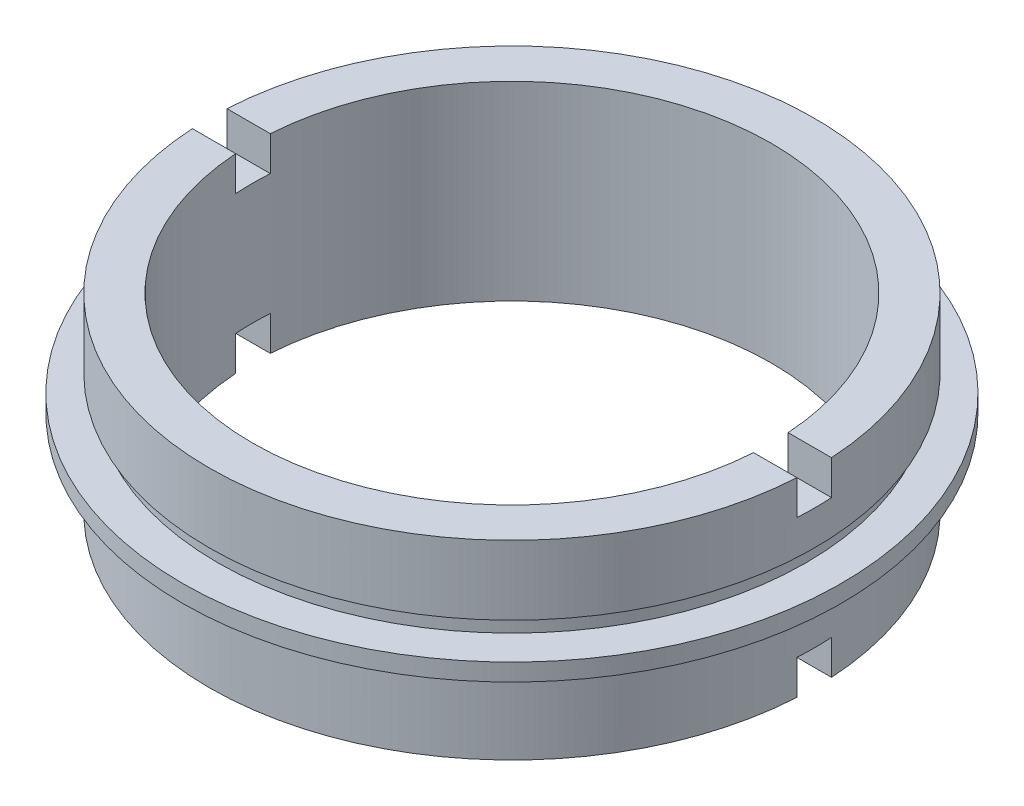
ISO-10303-21;
HEADER;
FILE_DESCRIPTION(('STEP AP214'),'2;1');
FILE_NAME('part.step','',(''),(''),'','','');
FILE_SCHEMA(('AUTOMOTIVE_DESIGN { 1 0 10303 214 1 1 1 1 }'));
ENDSEC;
DATA;
#1=APPLICATION_CONTEXT('core data for automotive mechanical design processes');
#2=APPLICATION_PROTOCOL_DEFINITION('international standard','automotive_design',2000,#1);
#3=PRODUCT_CONTEXT('',#1,'mechanical');
#4=PRODUCT('Part','Part','',(#3));
#5=PRODUCT_RELATED_PRODUCT_CATEGORY('part','',(#4));
#6=PRODUCT_DEFINITION_FORMATION('','',#4);
#7=PRODUCT_DEFINITION_CONTEXT('part definition',#1,'design');
#8=PRODUCT_DEFINITION('design','',#6,#7);
#9=PRODUCT_DEFINITION_SHAPE('','',#8);
#10=(LENGTH_UNIT() NAMED_UNIT(*) SI_UNIT(.MILLI.,.METRE.));
#11=(NAMED_UNIT(*) PLANE_ANGLE_UNIT() SI_UNIT($,.RADIAN.));
#12=(NAMED_UNIT(*) SI_UNIT($,.STERADIAN.) SOLID_ANGLE_UNIT());
#13=UNCERTAINTY_MEASURE_WITH_UNIT(LENGTH_MEASURE(1.E-05),#10,'distance_accuracy_value','');
#14=(GEOMETRIC_REPRESENTATION_CONTEXT(3) GLOBAL_UNCERTAINTY_ASSIGNED_CONTEXT((#13)) GLOBAL_UNIT_ASSIGNED_CONTEXT((#10,
#11,#12)) REPRESENTATION_CONTEXT('',''));
#15=CARTESIAN_POINT('',(0.,0.,0.));
#16=DIRECTION('',(0.,0.,1.));
#17=DIRECTION('',(1.,0.,0.));
#18=AXIS2_PLACEMENT_3D('',#15,#16,#17);
#19=CARTESIAN_POINT('',(-17.5,0.,0.));
#20=DIRECTION('',(0.,-1.,0.));
#21=DIRECTION('',(0.,0.,-1.));
#22=AXIS2_PLACEMENT_3D('',#19,#20,#21);
#23=PLANE('',#22);
#24=DIRECTION('',(-1.,0.,0.));
#25=VECTOR('',#24,1.);
#26=CARTESIAN_POINT('',(-17.5,0.,1.));
#27=LINE('',#26,#25);
#28=CARTESIAN_POINT('',(17.4714052096561,0.,1.));
#29=VERTEX_POINT('',#28);
#30=CARTESIAN_POINT('',(14.9666295470958,0.,1.));
#31=VERTEX_POINT('',#30);
#32=EDGE_CURVE('E265',#29,#31,#27,.T.);
#33=ORIENTED_EDGE('',*,*,#32,.F.);
#34=CARTESIAN_POINT('',(0.,0.,0.));
#35=DIRECTION('',(0.,1.,0.));
#36=DIRECTION('',(0.,0.,1.));
#37=AXIS2_PLACEMENT_3D('',#34,#35,#36);
#38=CIRCLE('',#37,17.5);
#39=CARTESIAN_POINT('',(-17.4714052096561,0.,1.));
#40=VERTEX_POINT('',#39);
#41=EDGE_CURVE('E214',#40,#29,#38,.T.);
#42=ORIENTED_EDGE('',*,*,#41,.F.);
#43=CARTESIAN_POINT('',(-14.9666295470958,0.,1.));
#44=VERTEX_POINT('',#43);
#45=EDGE_CURVE('E264',#44,#40,#27,.T.);
#46=ORIENTED_EDGE('',*,*,#45,.F.);
#47=CARTESIAN_POINT('',(0.,0.,0.));
#48=DIRECTION('',(0.,1.,0.));
#49=DIRECTION('',(0.,0.,1.));
#50=AXIS2_PLACEMENT_3D('',#47,#48,#49);
#51=CIRCLE('',#50,15.);
#52=EDGE_CURVE('E210',#44,#31,#51,.T.);
#53=ORIENTED_EDGE('',*,*,#52,.T.);
#54=EDGE_LOOP('',(#33,#42,#46,#53));
#55=FACE_BOUND('',#54,.T.);
#56=ADVANCED_FACE('F35',(#55),#23,.T.);
#57=CARTESIAN_POINT('',(-15.,11.,0.));
#58=DIRECTION('',(0.,1.,0.));
#59=DIRECTION('',(0.,0.,1.));
#60=AXIS2_PLACEMENT_3D('',#57,#58,#59);
#61=PLANE('',#60);
#62=DIRECTION('',(1.,0.,0.));
#63=VECTOR('',#62,1.);
#64=CARTESIAN_POINT('',(-15.,11.,1.));
#65=LINE('',#64,#63);
#66=CARTESIAN_POINT('',(-17.4714052096561,11.,1.));
#67=VERTEX_POINT('',#66);
#68=CARTESIAN_POINT('',(-14.9666295470958,11.,1.));
#69=VERTEX_POINT('',#68);
#70=EDGE_CURVE('E203',#67,#69,#65,.T.);
#71=ORIENTED_EDGE('',*,*,#70,.F.);
#72=CARTESIAN_POINT('',(0.,11.,0.));
#73=DIRECTION('',(0.,1.,0.));
#74=DIRECTION('',(0.,0.,1.));
#75=AXIS2_PLACEMENT_3D('',#72,#73,#74);
#76=CIRCLE('',#75,17.5);
#77=CARTESIAN_POINT('',(17.4714052096561,11.,1.));
#78=VERTEX_POINT('',#77);
#79=EDGE_CURVE('E241',#67,#78,#76,.T.);
#80=ORIENTED_EDGE('',*,*,#79,.T.);
#81=CARTESIAN_POINT('',(14.9666295470958,11.,1.));
#82=VERTEX_POINT('',#81);
#83=EDGE_CURVE('E206',#82,#78,#65,.T.);
#84=ORIENTED_EDGE('',*,*,#83,.F.);
#85=CARTESIAN_POINT('',(0.,11.,0.));
#86=DIRECTION('',(0.,1.,0.));
#87=DIRECTION('',(0.,0.,1.));
#88=AXIS2_PLACEMENT_3D('',#85,#86,#87);
#89=CIRCLE('',#88,15.);
#90=EDGE_CURVE('E245',#69,#82,#89,.T.);
#91=ORIENTED_EDGE('',*,*,#90,.F.);
#92=EDGE_LOOP('',(#71,#80,#84,#91));
#93=FACE_BOUND('',#92,.T.);
#94=ADVANCED_FACE('F303',(#93),#61,.T.);
#95=CARTESIAN_POINT('',(0.,22.6774994510759,0.));
#96=DIRECTION('',(0.,1.,0.));
#97=DIRECTION('',(0.,0.,1.));
#98=AXIS2_PLACEMENT_3D('',#95,#96,#97);
#99=CYLINDRICAL_SURFACE('',#98,15.);
#100=DIRECTION('',(0.,1.,0.));
#101=VECTOR('',#100,1.);
#102=CARTESIAN_POINT('',(-14.9666295470958,22.6774994510759,1.));
#103=LINE('',#102,#101);
#104=CARTESIAN_POINT('',(-14.9666295470958,2.,1.));
#105=VERTEX_POINT('',#104);
#106=EDGE_CURVE('E177',#105,#44,#103,.F.);
#107=ORIENTED_EDGE('',*,*,#106,.F.);
#108=CARTESIAN_POINT('',(0.,2.,0.));
#109=DIRECTION('',(0.,1.,0.));
#110=DIRECTION('',(0.,0.,1.));
#111=AXIS2_PLACEMENT_3D('',#108,#109,#110);
#112=CIRCLE('',#111,15.);
#113=CARTESIAN_POINT('',(-14.9666295470958,2.,-1.));
#114=VERTEX_POINT('',#113);
#115=EDGE_CURVE('E183',#114,#105,#112,.T.);
#116=ORIENTED_EDGE('',*,*,#115,.F.);
#117=DIRECTION('',(0.,1.,0.));
#118=VECTOR('',#117,1.);
#119=CARTESIAN_POINT('',(-14.9666295470958,22.6774994510759,-0.999999999999994));
#120=LINE('',#119,#118);
#121=CARTESIAN_POINT('',(-14.9666295470958,0.,-1.));
#122=VERTEX_POINT('',#121);
#123=EDGE_CURVE('E159',#122,#114,#120,.T.);
#124=ORIENTED_EDGE('',*,*,#123,.F.);
#125=CARTESIAN_POINT('',(14.9666295470958,0.,-1.));
#126=VERTEX_POINT('',#125);
#127=EDGE_CURVE('E213',#126,#122,#51,.T.);
#128=ORIENTED_EDGE('',*,*,#127,.F.);
#129=DIRECTION('',(0.,1.,0.));
#130=VECTOR('',#129,1.);
#131=CARTESIAN_POINT('',(14.9666295470958,22.6774994510759,-0.999999999999994));
#132=LINE('',#131,#130);
#133=CARTESIAN_POINT('',(14.9666295470958,2.,-1.));
#134=VERTEX_POINT('',#133);
#135=EDGE_CURVE('E58',#134,#126,#132,.F.);
#136=ORIENTED_EDGE('',*,*,#135,.F.);
#137=CARTESIAN_POINT('',(14.9666295470958,2.,1.));
#138=VERTEX_POINT('',#137);
#139=EDGE_CURVE('E185',#138,#134,#112,.T.);
#140=ORIENTED_EDGE('',*,*,#139,.F.);
#141=DIRECTION('',(0.,1.,0.));
#142=VECTOR('',#141,1.);
#143=CARTESIAN_POINT('',(14.9666295470958,22.6774994510759,1.));
#144=LINE('',#143,#142);
#145=EDGE_CURVE('E181',#31,#138,#144,.T.);
#146=ORIENTED_EDGE('',*,*,#145,.F.);
#147=ORIENTED_EDGE('',*,*,#52,.F.);
#148=EDGE_LOOP('',(#107,#116,#124,#128,#136,#140,#146,#147));
#149=FACE_BOUND('',#148,.T.);
#150=DIRECTION('',(0.,1.,0.));
#151=VECTOR('',#150,1.);
#152=CARTESIAN_POINT('',(14.9666295470958,22.6774994510759,1.));
#153=LINE('',#152,#151);
#154=CARTESIAN_POINT('',(14.9666295470958,9.,1.));
#155=VERTEX_POINT('',#154);
#156=EDGE_CURVE('E208',#155,#82,#153,.T.);
#157=ORIENTED_EDGE('',*,*,#156,.F.);
#158=CARTESIAN_POINT('',(0.,9.,0.));
#159=DIRECTION('',(0.,-1.,0.));
#160=DIRECTION('',(0.,0.,-1.));
#161=AXIS2_PLACEMENT_3D('',#158,#159,#160);
#162=CIRCLE('',#161,15.);
#163=CARTESIAN_POINT('',(14.9666295470958,9.,-0.999999999999997));
#164=VERTEX_POINT('',#163);
#165=EDGE_CURVE('E195',#164,#155,#162,.T.);
#166=ORIENTED_EDGE('',*,*,#165,.F.);
#167=DIRECTION('',(0.,1.,0.));
#168=VECTOR('',#167,1.);
#169=CARTESIAN_POINT('',(14.9666295470958,22.6774994510759,-1.));
#170=LINE('',#169,#168);
#171=CARTESIAN_POINT('',(14.9666295470958,11.,-0.999999999999998));
#172=VERTEX_POINT('',#171);
#173=EDGE_CURVE('E198',#172,#164,#170,.F.);
#174=ORIENTED_EDGE('',*,*,#173,.F.);
#175=CARTESIAN_POINT('',(-14.9666295470958,11.,-0.999999999999998));
#176=VERTEX_POINT('',#175);
#177=EDGE_CURVE('E248',#172,#176,#89,.T.);
#178=ORIENTED_EDGE('',*,*,#177,.T.);
#179=DIRECTION('',(0.,1.,0.));
#180=VECTOR('',#179,1.);
#181=CARTESIAN_POINT('',(-14.9666295470958,22.6774994510759,-1.));
#182=LINE('',#181,#180);
#183=CARTESIAN_POINT('',(-14.9666295470958,9.,-0.999999999999997));
#184=VERTEX_POINT('',#183);
#185=EDGE_CURVE('E201',#184,#176,#182,.T.);
#186=ORIENTED_EDGE('',*,*,#185,.F.);
#187=CARTESIAN_POINT('',(-14.9666295470958,9.,1.));
#188=VERTEX_POINT('',#187);
#189=EDGE_CURVE('E193',#188,#184,#162,.T.);
#190=ORIENTED_EDGE('',*,*,#189,.F.);
#191=DIRECTION('',(0.,1.,0.));
#192=VECTOR('',#191,1.);
#193=CARTESIAN_POINT('',(-14.9666295470958,22.6774994510759,1.));
#194=LINE('',#193,#192);
#195=EDGE_CURVE('E205',#69,#188,#194,.F.);
#196=ORIENTED_EDGE('',*,*,#195,.F.);
#197=ORIENTED_EDGE('',*,*,#90,.T.);
#198=EDGE_LOOP('',(#157,#166,#174,#178,#186,#190,#196,#197));
#199=FACE_BOUND('',#198,.T.);
#200=ADVANCED_FACE('F37',(#149,#199),#99,.F.);
#201=DIRECTION('',(-1.,0.,0.));
#202=VECTOR('',#201,1.);
#203=CARTESIAN_POINT('',(-15.,11.,-0.999999999999998));
#204=LINE('',#203,#202);
#205=CARTESIAN_POINT('',(17.4714052096561,11.,-1.));
#206=VERTEX_POINT('',#205);
#207=EDGE_CURVE('E196',#206,#172,#204,.T.);
#208=ORIENTED_EDGE('',*,*,#207,.F.);
#209=CARTESIAN_POINT('',(-17.4714052096561,11.,-1.));
#210=VERTEX_POINT('',#209);
#211=EDGE_CURVE('E244',#206,#210,#76,.T.);
#212=ORIENTED_EDGE('',*,*,#211,.T.);
#213=EDGE_CURVE('E199',#176,#210,#204,.T.);
#214=ORIENTED_EDGE('',*,*,#213,.F.);
#215=ORIENTED_EDGE('',*,*,#177,.F.);
#216=EDGE_LOOP('',(#208,#212,#214,#215));
#217=FACE_BOUND('',#216,.T.);
#218=ADVANCED_FACE('F309',(#217),#61,.T.);
#219=CARTESIAN_POINT('',(0.,22.6774994510759,0.));
#220=DIRECTION('',(0.,1.,0.));
#221=DIRECTION('',(0.,0.,1.));
#222=AXIS2_PLACEMENT_3D('',#219,#220,#221);
#223=CYLINDRICAL_SURFACE('',#222,17.5);
#224=DIRECTION('',(0.,1.,0.));
#225=VECTOR('',#224,1.);
#226=CARTESIAN_POINT('',(-17.4714052096561,22.6774994510759,1.));
#227=LINE('',#226,#225);
#228=CARTESIAN_POINT('',(-17.4714052096561,9.,1.));
#229=VERTEX_POINT('',#228);
#230=EDGE_CURVE('E260',#229,#67,#227,.T.);
#231=ORIENTED_EDGE('',*,*,#230,.F.);
#232=CARTESIAN_POINT('',(0.,9.,0.));
#233=DIRECTION('',(0.,-1.,0.));
#234=DIRECTION('',(0.,0.,-1.));
#235=AXIS2_PLACEMENT_3D('',#232,#233,#234);
#236=CIRCLE('',#235,17.5);
#237=CARTESIAN_POINT('',(-17.4714052096561,9.,-0.999999999999997));
#238=VERTEX_POINT('',#237);
#239=EDGE_CURVE('E252',#238,#229,#236,.F.);
#240=ORIENTED_EDGE('',*,*,#239,.F.);
#241=DIRECTION('',(0.,1.,0.));
#242=VECTOR('',#241,1.);
#243=CARTESIAN_POINT('',(-17.4714052096561,22.6774994510759,-1.));
#244=LINE('',#243,#242);
#245=EDGE_CURVE('E257',#210,#238,#244,.F.);
#246=ORIENTED_EDGE('',*,*,#245,.F.);
#247=ORIENTED_EDGE('',*,*,#211,.F.);
#248=DIRECTION('',(0.,1.,0.));
#249=VECTOR('',#248,1.);
#250=CARTESIAN_POINT('',(17.4714052096561,22.6774994510759,-1.));
#251=LINE('',#250,#249);
#252=CARTESIAN_POINT('',(17.4714052096561,9.,-0.999999999999997));
#253=VERTEX_POINT('',#252);
#254=EDGE_CURVE('E251',#253,#206,#251,.T.);
#255=ORIENTED_EDGE('',*,*,#254,.F.);
#256=CARTESIAN_POINT('',(17.4714052096561,9.,1.));
#257=VERTEX_POINT('',#256);
#258=EDGE_CURVE('E249',#257,#253,#236,.F.);
#259=ORIENTED_EDGE('',*,*,#258,.F.);
#260=DIRECTION('',(0.,1.,0.));
#261=VECTOR('',#260,1.);
#262=CARTESIAN_POINT('',(17.4714052096561,22.6774994510759,1.));
#263=LINE('',#262,#261);
#264=EDGE_CURVE('E254',#78,#257,#263,.F.);
#265=ORIENTED_EDGE('',*,*,#264,.F.);
#266=ORIENTED_EDGE('',*,*,#79,.F.);
#267=EDGE_LOOP('',(#231,#240,#246,#247,#255,#259,#265,#266));
#268=FACE_BOUND('',#267,.T.);
#269=CARTESIAN_POINT('',(0.,7.,0.));
#270=DIRECTION('',(0.,1.,0.));
#271=DIRECTION('',(0.,0.,1.));
#272=AXIS2_PLACEMENT_3D('',#269,#270,#271);
#273=CIRCLE('',#272,17.5);
#274=CARTESIAN_POINT('',(0.,7.,17.5));
#275=VERTEX_POINT('',#274);
#276=EDGE_CURVE('E238',#275,#275,#273,.T.);
#277=ORIENTED_EDGE('',*,*,#276,.T.);
#278=EDGE_LOOP('',(#277));
#279=FACE_BOUND('',#278,.T.);
#280=ADVANCED_FACE('F352',(#268,#279),#223,.T.);
#281=CARTESIAN_POINT('',(-17.5,7.,0.));
#282=DIRECTION('',(0.,-1.,0.));
#283=DIRECTION('',(0.,0.,-1.));
#284=AXIS2_PLACEMENT_3D('',#281,#282,#283);
#285=PLANE('',#284);
#286=CARTESIAN_POINT('',(0.,7.,0.));
#287=DIRECTION('',(0.,1.,0.));
#288=DIRECTION('',(0.,0.,1.));
#289=AXIS2_PLACEMENT_3D('',#286,#287,#288);
#290=CIRCLE('',#289,17.);
#291=CARTESIAN_POINT('',(0.,7.,17.));
#292=VERTEX_POINT('',#291);
#293=EDGE_CURVE('E235',#292,#292,#290,.T.);
#294=ORIENTED_EDGE('',*,*,#293,.T.);
#295=EDGE_LOOP('',(#294));
#296=FACE_BOUND('',#295,.T.);
#297=ORIENTED_EDGE('',*,*,#276,.F.);
#298=EDGE_LOOP('',(#297));
#299=FACE_BOUND('',#298,.T.);
#300=ADVANCED_FACE('F348',(#296,#299),#285,.T.);
#301=CARTESIAN_POINT('',(0.,22.6774994510759,0.));
#302=DIRECTION('',(0.,1.,0.));
#303=DIRECTION('',(0.,0.,1.));
#304=AXIS2_PLACEMENT_3D('',#301,#302,#303);
#305=CYLINDRICAL_SURFACE('',#304,17.);
#306=CARTESIAN_POINT('',(0.,6.,0.));
#307=DIRECTION('',(0.,1.,0.));
#308=DIRECTION('',(0.,0.,1.));
#309=AXIS2_PLACEMENT_3D('',#306,#307,#308);
#310=CIRCLE('',#309,17.);
#311=CARTESIAN_POINT('',(0.,6.,17.));
#312=VERTEX_POINT('',#311);
#313=EDGE_CURVE('E232',#312,#312,#310,.T.);
#314=ORIENTED_EDGE('',*,*,#313,.T.);
#315=EDGE_LOOP('',(#314));
#316=FACE_BOUND('',#315,.T.);
#317=ORIENTED_EDGE('',*,*,#293,.F.);
#318=EDGE_LOOP('',(#317));
#319=FACE_BOUND('',#318,.T.);
#320=ADVANCED_FACE('F344',(#316,#319),#305,.T.);
#321=CARTESIAN_POINT('',(-17.,6.,0.));
#322=DIRECTION('',(0.,1.,0.));
#323=DIRECTION('',(0.,0.,1.));
#324=AXIS2_PLACEMENT_3D('',#321,#322,#323);
#325=PLANE('',#324);
#326=CARTESIAN_POINT('',(0.,6.,0.));
#327=DIRECTION('',(0.,1.,0.));
#328=DIRECTION('',(0.,0.,1.));
#329=AXIS2_PLACEMENT_3D('',#326,#327,#328);
#330=CIRCLE('',#329,19.05);
#331=CARTESIAN_POINT('',(0.,6.,19.05));
#332=VERTEX_POINT('',#331);
#333=EDGE_CURVE('E229',#332,#332,#330,.T.);
#334=ORIENTED_EDGE('',*,*,#333,.T.);
#335=EDGE_LOOP('',(#334));
#336=FACE_BOUND('',#335,.T.);
#337=ORIENTED_EDGE('',*,*,#313,.F.);
#338=EDGE_LOOP('',(#337));
#339=FACE_BOUND('',#338,.T.);
#340=ADVANCED_FACE('F340',(#336,#339),#325,.T.);
#341=CARTESIAN_POINT('',(0.,22.6774994510759,0.));
#342=DIRECTION('',(0.,1.,0.));
#343=DIRECTION('',(0.,0.,1.));
#344=AXIS2_PLACEMENT_3D('',#341,#342,#343);
#345=CYLINDRICAL_SURFACE('',#344,19.05);
#346=CARTESIAN_POINT('',(0.,5.,0.));
#347=DIRECTION('',(0.,1.,0.));
#348=DIRECTION('',(0.,0.,1.));
#349=AXIS2_PLACEMENT_3D('',#346,#347,#348);
#350=CIRCLE('',#349,19.05);
#351=CARTESIAN_POINT('',(0.,5.,19.05));
#352=VERTEX_POINT('',#351);
#353=EDGE_CURVE('E226',#352,#352,#350,.T.);
#354=ORIENTED_EDGE('',*,*,#353,.T.);
#355=EDGE_LOOP('',(#354));
#356=FACE_BOUND('',#355,.T.);
#357=ORIENTED_EDGE('',*,*,#333,.F.);
#358=EDGE_LOOP('',(#357));
#359=FACE_BOUND('',#358,.T.);
#360=ADVANCED_FACE('F336',(#356,#359),#345,.T.);
#361=CARTESIAN_POINT('',(-19.05,5.,0.));
#362=DIRECTION('',(0.,-1.,0.));
#363=DIRECTION('',(0.,0.,-1.));
#364=AXIS2_PLACEMENT_3D('',#361,#362,#363);
#365=PLANE('',#364);
#366=CARTESIAN_POINT('',(0.,5.,0.));
#367=DIRECTION('',(0.,1.,0.));
#368=DIRECTION('',(0.,0.,1.));
#369=AXIS2_PLACEMENT_3D('',#366,#367,#368);
#370=CIRCLE('',#369,17.);
#371=CARTESIAN_POINT('',(0.,5.,17.));
#372=VERTEX_POINT('',#371);
#373=EDGE_CURVE('E223',#372,#372,#370,.T.);
#374=ORIENTED_EDGE('',*,*,#373,.T.);
#375=EDGE_LOOP('',(#374));
#376=FACE_BOUND('',#375,.T.);
#377=ORIENTED_EDGE('',*,*,#353,.F.);
#378=EDGE_LOOP('',(#377));
#379=FACE_BOUND('',#378,.T.);
#380=ADVANCED_FACE('F332',(#376,#379),#365,.T.);
#381=CARTESIAN_POINT('',(0.,22.6774994510759,0.));
#382=DIRECTION('',(0.,1.,0.));
#383=DIRECTION('',(0.,0.,1.));
#384=AXIS2_PLACEMENT_3D('',#381,#382,#383);
#385=CYLINDRICAL_SURFACE('',#384,17.);
#386=CARTESIAN_POINT('',(0.,4.,0.));
#387=DIRECTION('',(0.,1.,0.));
#388=DIRECTION('',(0.,0.,1.));
#389=AXIS2_PLACEMENT_3D('',#386,#387,#388);
#390=CIRCLE('',#389,17.);
#391=CARTESIAN_POINT('',(0.,4.,17.));
#392=VERTEX_POINT('',#391);
#393=EDGE_CURVE('E220',#392,#392,#390,.T.);
#394=ORIENTED_EDGE('',*,*,#393,.T.);
#395=EDGE_LOOP('',(#394));
#396=FACE_BOUND('',#395,.T.);
#397=ORIENTED_EDGE('',*,*,#373,.F.);
#398=EDGE_LOOP('',(#397));
#399=FACE_BOUND('',#398,.T.);
#400=ADVANCED_FACE('F326',(#396,#399),#385,.T.);
#401=CARTESIAN_POINT('',(-17.,4.,0.));
#402=DIRECTION('',(0.,1.,0.));
#403=DIRECTION('',(0.,0.,1.));
#404=AXIS2_PLACEMENT_3D('',#401,#402,#403);
#405=PLANE('',#404);
#406=CARTESIAN_POINT('',(0.,4.,0.));
#407=DIRECTION('',(0.,1.,0.));
#408=DIRECTION('',(0.,0.,1.));
#409=AXIS2_PLACEMENT_3D('',#406,#407,#408);
#410=CIRCLE('',#409,17.5);
#411=CARTESIAN_POINT('',(0.,4.,17.5));
#412=VERTEX_POINT('',#411);
#413=EDGE_CURVE('E217',#412,#412,#410,.T.);
#414=ORIENTED_EDGE('',*,*,#413,.T.);
#415=EDGE_LOOP('',(#414));
#416=FACE_BOUND('',#415,.T.);
#417=ORIENTED_EDGE('',*,*,#393,.F.);
#418=EDGE_LOOP('',(#417));
#419=FACE_BOUND('',#418,.T.);
#420=ADVANCED_FACE('F322',(#416,#419),#405,.T.);
#421=CARTESIAN_POINT('',(0.,22.6774994510759,0.));
#422=DIRECTION('',(0.,1.,0.));
#423=DIRECTION('',(0.,0.,1.));
#424=AXIS2_PLACEMENT_3D('',#421,#422,#423);
#425=CYLINDRICAL_SURFACE('',#424,17.5);
#426=DIRECTION('',(0.,1.,0.));
#427=VECTOR('',#426,1.);
#428=CARTESIAN_POINT('',(-17.4714052096561,22.6774994510759,1.));
#429=LINE('',#428,#427);
#430=CARTESIAN_POINT('',(-17.4714052096561,2.,1.));
#431=VERTEX_POINT('',#430);
#432=EDGE_CURVE('E170',#40,#431,#429,.T.);
#433=ORIENTED_EDGE('',*,*,#432,.F.);
#434=ORIENTED_EDGE('',*,*,#41,.T.);
#435=DIRECTION('',(0.,1.,0.));
#436=VECTOR('',#435,1.);
#437=CARTESIAN_POINT('',(17.4714052096561,22.6774994510759,1.));
#438=LINE('',#437,#436);
#439=CARTESIAN_POINT('',(17.4714052096561,2.,1.));
#440=VERTEX_POINT('',#439);
#441=EDGE_CURVE('E179',#440,#29,#438,.F.);
#442=ORIENTED_EDGE('',*,*,#441,.F.);
#443=CARTESIAN_POINT('',(0.,2.,0.));
#444=DIRECTION('',(0.,1.,0.));
#445=DIRECTION('',(0.,0.,1.));
#446=AXIS2_PLACEMENT_3D('',#443,#444,#445);
#447=CIRCLE('',#446,17.5);
#448=CARTESIAN_POINT('',(17.4714052096561,2.,-1.));
#449=VERTEX_POINT('',#448);
#450=EDGE_CURVE('E39',#449,#440,#447,.F.);
#451=ORIENTED_EDGE('',*,*,#450,.F.);
#452=DIRECTION('',(0.,1.,0.));
#453=VECTOR('',#452,1.);
#454=CARTESIAN_POINT('',(17.4714052096561,22.6774994510759,-0.999999999999994));
#455=LINE('',#454,#453);
#456=CARTESIAN_POINT('',(17.4714052096561,0.,-1.));
#457=VERTEX_POINT('',#456);
#458=EDGE_CURVE('E172',#457,#449,#455,.T.);
#459=ORIENTED_EDGE('',*,*,#458,.F.);
#460=CARTESIAN_POINT('',(-17.4714052096561,0.,-1.));
#461=VERTEX_POINT('',#460);
#462=EDGE_CURVE('E168',#457,#461,#38,.T.);
#463=ORIENTED_EDGE('',*,*,#462,.T.);
#464=DIRECTION('',(0.,1.,0.));
#465=VECTOR('',#464,1.);
#466=CARTESIAN_POINT('',(-17.4714052096561,22.6774994510759,-0.999999999999994));
#467=LINE('',#466,#465);
#468=CARTESIAN_POINT('',(-17.4714052096561,2.,-1.));
#469=VERTEX_POINT('',#468);
#470=EDGE_CURVE('E50',#469,#461,#467,.F.);
#471=ORIENTED_EDGE('',*,*,#470,.F.);
#472=EDGE_CURVE('E11',#431,#469,#447,.F.);
#473=ORIENTED_EDGE('',*,*,#472,.F.);
#474=EDGE_LOOP('',(#433,#434,#442,#451,#459,#463,#471,#473));
#475=FACE_BOUND('',#474,.T.);
#476=ORIENTED_EDGE('',*,*,#413,.F.);
#477=EDGE_LOOP('',(#476));
#478=FACE_BOUND('',#477,.T.);
#479=ADVANCED_FACE('F164',(#475,#478),#425,.T.);
#480=DIRECTION('',(1.,0.,0.));
#481=VECTOR('',#480,1.);
#482=CARTESIAN_POINT('',(-17.5,0.,-1.));
#483=LINE('',#482,#481);
#484=EDGE_CURVE('E263',#461,#122,#483,.T.);
#485=ORIENTED_EDGE('',*,*,#484,.F.);
#486=ORIENTED_EDGE('',*,*,#462,.F.);
#487=EDGE_CURVE('E262',#126,#457,#483,.T.);
#488=ORIENTED_EDGE('',*,*,#487,.F.);
#489=ORIENTED_EDGE('',*,*,#127,.T.);
#490=EDGE_LOOP('',(#485,#486,#488,#489));
#491=FACE_BOUND('',#490,.T.);
#492=ADVANCED_FACE('F274',(#491),#23,.T.);
#493=CARTESIAN_POINT('',(-39.5,9.,1.));
#494=DIRECTION('',(0.,-1.,0.));
#495=DIRECTION('',(0.,0.,-1.));
#496=AXIS2_PLACEMENT_3D('',#493,#494,#495);
#497=PLANE('',#496);
#498=ORIENTED_EDGE('',*,*,#165,.T.);
#499=DIRECTION('',(1.,0.,0.));
#500=VECTOR('',#499,1.);
#501=CARTESIAN_POINT('',(-39.5,9.,1.));
#502=LINE('',#501,#500);
#503=EDGE_CURVE('E191',#155,#257,#502,.T.);
#504=ORIENTED_EDGE('',*,*,#503,.T.);
#505=ORIENTED_EDGE('',*,*,#258,.T.);
#506=DIRECTION('',(1.,0.,0.));
#507=VECTOR('',#506,1.);
#508=CARTESIAN_POINT('',(-39.5,9.,-0.999999999999997));
#509=LINE('',#508,#507);
#510=EDGE_CURVE('E186',#164,#253,#509,.T.);
#511=ORIENTED_EDGE('',*,*,#510,.F.);
#512=EDGE_LOOP('',(#498,#504,#505,#511));
#513=FACE_BOUND('',#512,.T.);
#514=ADVANCED_FACE('F313',(#513),#497,.F.);
#515=CARTESIAN_POINT('',(-39.5,13.5939878717808,-0.999999999999998));
#516=DIRECTION('',(0.,0.,-1.));
#517=DIRECTION('',(0.,1.,0.));
#518=AXIS2_PLACEMENT_3D('',#515,#516,#517);
#519=PLANE('',#518);
#520=ORIENTED_EDGE('',*,*,#173,.T.);
#521=ORIENTED_EDGE('',*,*,#510,.T.);
#522=ORIENTED_EDGE('',*,*,#254,.T.);
#523=ORIENTED_EDGE('',*,*,#207,.T.);
#524=EDGE_LOOP('',(#520,#521,#522,#523));
#525=FACE_BOUND('',#524,.T.);
#526=ADVANCED_FACE('F318',(#525),#519,.F.);
#527=CARTESIAN_POINT('',(-39.5,13.5939878717808,1.));
#528=DIRECTION('',(0.,0.,1.));
#529=DIRECTION('',(0.,-1.,0.));
#530=AXIS2_PLACEMENT_3D('',#527,#528,#529);
#531=PLANE('',#530);
#532=ORIENTED_EDGE('',*,*,#156,.T.);
#533=ORIENTED_EDGE('',*,*,#83,.T.);
#534=ORIENTED_EDGE('',*,*,#264,.T.);
#535=ORIENTED_EDGE('',*,*,#503,.F.);
#536=EDGE_LOOP('',(#532,#533,#534,#535));
#537=FACE_BOUND('',#536,.T.);
#538=ADVANCED_FACE('F401',(#537),#531,.F.);
#539=ORIENTED_EDGE('',*,*,#185,.T.);
#540=ORIENTED_EDGE('',*,*,#213,.T.);
#541=ORIENTED_EDGE('',*,*,#245,.T.);
#542=EDGE_CURVE('E189',#238,#184,#509,.T.);
#543=ORIENTED_EDGE('',*,*,#542,.T.);
#544=EDGE_LOOP('',(#539,#540,#541,#543));
#545=FACE_BOUND('',#544,.T.);
#546=ADVANCED_FACE('F377',(#545),#519,.F.);
#547=ORIENTED_EDGE('',*,*,#195,.T.);
#548=EDGE_CURVE('E190',#229,#188,#502,.T.);
#549=ORIENTED_EDGE('',*,*,#548,.F.);
#550=ORIENTED_EDGE('',*,*,#230,.T.);
#551=ORIENTED_EDGE('',*,*,#70,.T.);
#552=EDGE_LOOP('',(#547,#549,#550,#551));
#553=FACE_BOUND('',#552,.T.);
#554=ADVANCED_FACE('F392',(#553),#531,.F.);
#555=ORIENTED_EDGE('',*,*,#189,.T.);
#556=ORIENTED_EDGE('',*,*,#542,.F.);
#557=ORIENTED_EDGE('',*,*,#239,.T.);
#558=ORIENTED_EDGE('',*,*,#548,.T.);
#559=EDGE_LOOP('',(#555,#556,#557,#558));
#560=FACE_BOUND('',#559,.T.);
#561=ADVANCED_FACE('F321',(#560),#497,.F.);
#562=CARTESIAN_POINT('',(-39.5,2.,-1.));
#563=DIRECTION('',(0.,0.,-1.));
#564=DIRECTION('',(0.,1.,0.));
#565=AXIS2_PLACEMENT_3D('',#562,#563,#564);
#566=PLANE('',#565);
#567=ORIENTED_EDGE('',*,*,#135,.T.);
#568=ORIENTED_EDGE('',*,*,#487,.T.);
#569=ORIENTED_EDGE('',*,*,#458,.T.);
#570=DIRECTION('',(1.,0.,0.));
#571=VECTOR('',#570,1.);
#572=CARTESIAN_POINT('',(-39.5,2.,-1.));
#573=LINE('',#572,#571);
#574=EDGE_CURVE('E161',#134,#449,#573,.T.);
#575=ORIENTED_EDGE('',*,*,#574,.F.);
#576=EDGE_LOOP('',(#567,#568,#569,#575));
#577=FACE_BOUND('',#576,.T.);
#578=ADVANCED_FACE('F275',(#577),#566,.F.);
#579=CARTESIAN_POINT('',(-39.5,2.,1.));
#580=DIRECTION('',(0.,0.,1.));
#581=DIRECTION('',(0.,-1.,0.));
#582=AXIS2_PLACEMENT_3D('',#579,#580,#581);
#583=PLANE('',#582);
#584=ORIENTED_EDGE('',*,*,#145,.T.);
#585=DIRECTION('',(1.,0.,0.));
#586=VECTOR('',#585,1.);
#587=CARTESIAN_POINT('',(-39.5,2.,1.));
#588=LINE('',#587,#586);
#589=EDGE_CURVE('E160',#138,#440,#588,.T.);
#590=ORIENTED_EDGE('',*,*,#589,.T.);
#591=ORIENTED_EDGE('',*,*,#441,.T.);
#592=ORIENTED_EDGE('',*,*,#32,.T.);
#593=EDGE_LOOP('',(#584,#590,#591,#592));
#594=FACE_BOUND('',#593,.T.);
#595=ADVANCED_FACE('F283',(#594),#583,.F.);
#596=CARTESIAN_POINT('',(-39.5,2.,1.));
#597=DIRECTION('',(0.,1.,0.));
#598=DIRECTION('',(0.,0.,1.));
#599=AXIS2_PLACEMENT_3D('',#596,#597,#598);
#600=PLANE('',#599);
#601=ORIENTED_EDGE('',*,*,#139,.T.);
#602=ORIENTED_EDGE('',*,*,#574,.T.);
#603=ORIENTED_EDGE('',*,*,#450,.T.);
#604=ORIENTED_EDGE('',*,*,#589,.F.);
#605=EDGE_LOOP('',(#601,#602,#603,#604));
#606=FACE_BOUND('',#605,.T.);
#607=ADVANCED_FACE('F291',(#606),#600,.F.);
#608=ORIENTED_EDGE('',*,*,#123,.T.);
#609=EDGE_CURVE('E151',#469,#114,#573,.T.);
#610=ORIENTED_EDGE('',*,*,#609,.F.);
#611=ORIENTED_EDGE('',*,*,#470,.T.);
#612=ORIENTED_EDGE('',*,*,#484,.T.);
#613=EDGE_LOOP('',(#608,#610,#611,#612));
#614=FACE_BOUND('',#613,.T.);
#615=ADVANCED_FACE('F157',(#614),#566,.F.);
#616=ORIENTED_EDGE('',*,*,#106,.T.);
#617=ORIENTED_EDGE('',*,*,#45,.T.);
#618=ORIENTED_EDGE('',*,*,#432,.T.);
#619=EDGE_CURVE('E154',#431,#105,#588,.T.);
#620=ORIENTED_EDGE('',*,*,#619,.T.);
#621=EDGE_LOOP('',(#616,#617,#618,#620));
#622=FACE_BOUND('',#621,.T.);
#623=ADVANCED_FACE('F298',(#622),#583,.F.);
#624=ORIENTED_EDGE('',*,*,#115,.T.);
#625=ORIENTED_EDGE('',*,*,#619,.F.);
#626=ORIENTED_EDGE('',*,*,#472,.T.);
#627=ORIENTED_EDGE('',*,*,#609,.T.);
#628=EDGE_LOOP('',(#624,#625,#626,#627));
#629=FACE_BOUND('',#628,.T.);
#630=ADVANCED_FACE('F150',(#629),#600,.F.);
#631=CLOSED_SHELL('',(#56,#94,#200,#218,#280,#300,#320,#340,#360,#380,#400,#420,#479,#492,#514,
#526,#538,#546,#554,#561,#578,#595,#607,#615,#623,#630));
#632=MANIFOLD_SOLID_BREP('B2',#631);
#633=ADVANCED_BREP_SHAPE_REPRESENTATION('',(#18,#632),#14);
#634=SHAPE_DEFINITION_REPRESENTATION(#9,#633);
ENDSEC;
END-ISO-10303-21;
